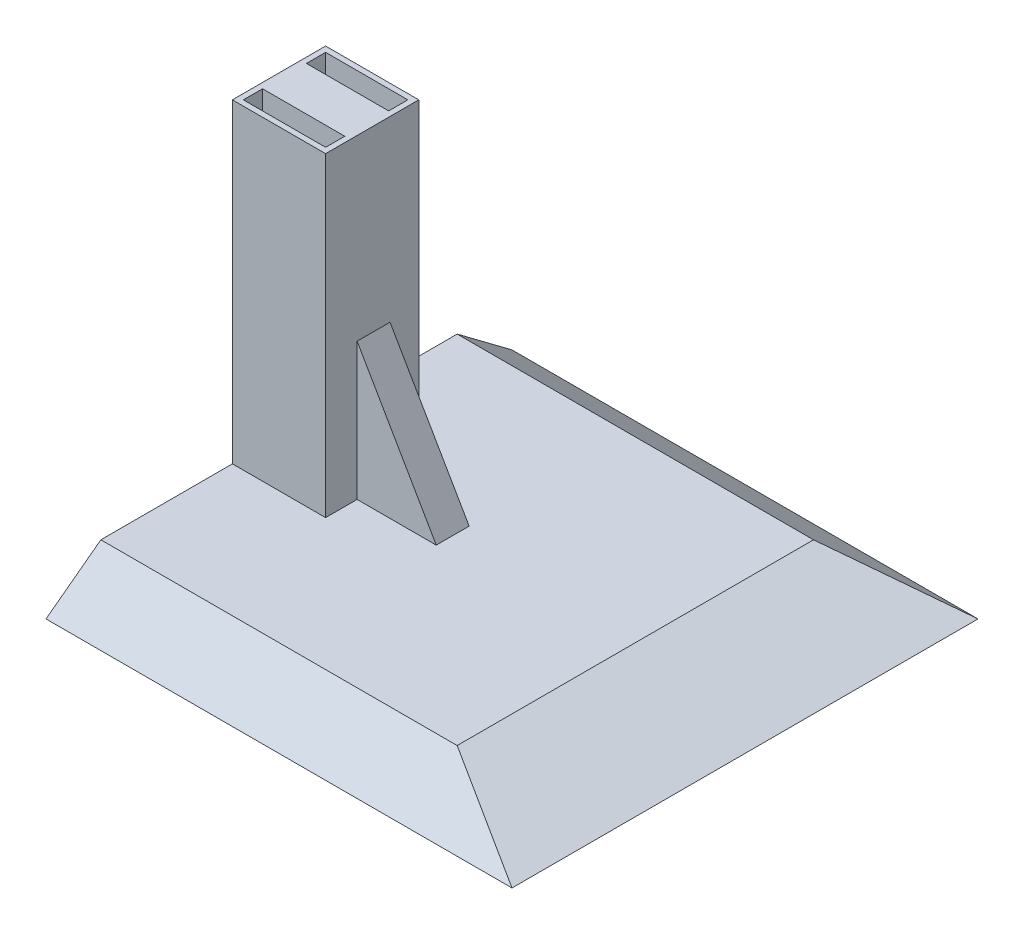
ISO-10303-21;
HEADER;
FILE_DESCRIPTION(('STEP AP214'),'2;1');
FILE_NAME('part.step','',(''),(''),'','','');
FILE_SCHEMA(('AUTOMOTIVE_DESIGN { 1 0 10303 214 1 1 1 1 }'));
ENDSEC;
DATA;
#1=APPLICATION_CONTEXT('core data for automotive mechanical design processes');
#2=APPLICATION_PROTOCOL_DEFINITION('international standard','automotive_design',2000,#1);
#3=PRODUCT_CONTEXT('',#1,'mechanical');
#4=PRODUCT('Part','Part','',(#3));
#5=PRODUCT_RELATED_PRODUCT_CATEGORY('part','',(#4));
#6=PRODUCT_DEFINITION_FORMATION('','',#4);
#7=PRODUCT_DEFINITION_CONTEXT('part definition',#1,'design');
#8=PRODUCT_DEFINITION('design','',#6,#7);
#9=PRODUCT_DEFINITION_SHAPE('','',#8);
#10=(LENGTH_UNIT() NAMED_UNIT(*) SI_UNIT(.MILLI.,.METRE.));
#11=(NAMED_UNIT(*) PLANE_ANGLE_UNIT() SI_UNIT($,.RADIAN.));
#12=(NAMED_UNIT(*) SI_UNIT($,.STERADIAN.) SOLID_ANGLE_UNIT());
#13=UNCERTAINTY_MEASURE_WITH_UNIT(LENGTH_MEASURE(1.E-05),#10,'distance_accuracy_value','');
#14=(GEOMETRIC_REPRESENTATION_CONTEXT(3) GLOBAL_UNCERTAINTY_ASSIGNED_CONTEXT((#13)) GLOBAL_UNIT_ASSIGNED_CONTEXT((#10,
#11,#12)) REPRESENTATION_CONTEXT('',''));
#15=CARTESIAN_POINT('',(0.,0.,0.));
#16=DIRECTION('',(0.,0.,1.));
#17=DIRECTION('',(1.,0.,0.));
#18=AXIS2_PLACEMENT_3D('',#15,#16,#17);
#19=CARTESIAN_POINT('',(0.,7.5,0.));
#20=DIRECTION('',(0.,1.,0.));
#21=DIRECTION('',(0.,0.,1.));
#22=AXIS2_PLACEMENT_3D('',#19,#20,#21);
#23=PLANE('',#22);
#24=DIRECTION('',(0.,0.,-1.));
#25=VECTOR('',#24,1.);
#26=CARTESIAN_POINT('',(-25.5,7.5,8.50000000000001));
#27=LINE('',#26,#25);
#28=CARTESIAN_POINT('',(-25.5,7.5,-3.25));
#29=VERTEX_POINT('',#28);
#30=CARTESIAN_POINT('',(-25.5,7.5,-8.49999999999999));
#31=VERTEX_POINT('',#30);
#32=EDGE_CURVE('E195',#29,#31,#27,.T.);
#33=ORIENTED_EDGE('',*,*,#32,.F.);
#34=DIRECTION('',(1.,0.,0.));
#35=VECTOR('',#34,1.);
#36=CARTESIAN_POINT('',(-25.5,7.5,-3.25));
#37=LINE('',#36,#35);
#38=CARTESIAN_POINT('',(-11.0662432702594,7.5,-3.25));
#39=VERTEX_POINT('',#38);
#40=EDGE_CURVE('E181',#29,#39,#37,.T.);
#41=ORIENTED_EDGE('',*,*,#40,.T.);
#42=DIRECTION('',(0.,0.,1.));
#43=VECTOR('',#42,1.);
#44=CARTESIAN_POINT('',(-11.0662432702594,7.5,-3.25));
#45=LINE('',#44,#43);
#46=CARTESIAN_POINT('',(-11.0662432702594,7.5,2.75));
#47=VERTEX_POINT('',#46);
#48=EDGE_CURVE('E490',#39,#47,#45,.T.);
#49=ORIENTED_EDGE('',*,*,#48,.T.);
#50=DIRECTION('',(1.,0.,0.));
#51=VECTOR('',#50,1.);
#52=CARTESIAN_POINT('',(-25.5,7.5,2.75));
#53=LINE('',#52,#51);
#54=CARTESIAN_POINT('',(-25.5,7.5,2.75));
#55=VERTEX_POINT('',#54);
#56=EDGE_CURVE('E489',#55,#47,#53,.T.);
#57=ORIENTED_EDGE('',*,*,#56,.F.);
#58=CARTESIAN_POINT('',(-25.5,7.5,8.50000000000001));
#59=VERTEX_POINT('',#58);
#60=EDGE_CURVE('E204',#59,#55,#27,.T.);
#61=ORIENTED_EDGE('',*,*,#60,.F.);
#62=DIRECTION('',(-1.,0.,0.));
#63=VECTOR('',#62,1.);
#64=CARTESIAN_POINT('',(-25.5,7.5,8.50000000000001));
#65=LINE('',#64,#63);
#66=CARTESIAN_POINT('',(-42.5,7.5,8.50000000000002));
#67=VERTEX_POINT('',#66);
#68=EDGE_CURVE('E205',#59,#67,#65,.T.);
#69=ORIENTED_EDGE('',*,*,#68,.T.);
#70=DIRECTION('',(0.,0.,1.));
#71=VECTOR('',#70,1.);
#72=CARTESIAN_POINT('',(-42.5,7.5,32.5));
#73=LINE('',#72,#71);
#74=CARTESIAN_POINT('',(-42.5,7.5,32.5));
#75=VERTEX_POINT('',#74);
#76=EDGE_CURVE('E316',#67,#75,#73,.T.);
#77=ORIENTED_EDGE('',*,*,#76,.T.);
#78=DIRECTION('',(1.,0.,0.));
#79=VECTOR('',#78,1.);
#80=CARTESIAN_POINT('',(22.5,7.5,32.5));
#81=LINE('',#80,#79);
#82=CARTESIAN_POINT('',(22.5,7.5,32.5));
#83=VERTEX_POINT('',#82);
#84=EDGE_CURVE('E12',#75,#83,#81,.T.);
#85=ORIENTED_EDGE('',*,*,#84,.T.);
#86=DIRECTION('',(0.,0.,-1.));
#87=VECTOR('',#86,1.);
#88=CARTESIAN_POINT('',(22.5,7.5,32.5));
#89=LINE('',#88,#87);
#90=CARTESIAN_POINT('',(22.5,7.5,-32.5));
#91=VERTEX_POINT('',#90);
#92=EDGE_CURVE('E57',#83,#91,#89,.T.);
#93=ORIENTED_EDGE('',*,*,#92,.T.);
#94=DIRECTION('',(-1.,0.,0.));
#95=VECTOR('',#94,1.);
#96=CARTESIAN_POINT('',(22.5,7.5,-32.5));
#97=LINE('',#96,#95);
#98=CARTESIAN_POINT('',(-42.5,7.5,-32.5));
#99=VERTEX_POINT('',#98);
#100=EDGE_CURVE('E397',#91,#99,#97,.T.);
#101=ORIENTED_EDGE('',*,*,#100,.T.);
#102=CARTESIAN_POINT('',(-42.5,7.5,-8.49999999999999));
#103=VERTEX_POINT('',#102);
#104=EDGE_CURVE('E51',#99,#103,#73,.T.);
#105=ORIENTED_EDGE('',*,*,#104,.T.);
#106=DIRECTION('',(-1.,0.,0.));
#107=VECTOR('',#106,1.);
#108=CARTESIAN_POINT('',(-25.5,7.5,-8.49999999999999));
#109=LINE('',#108,#107);
#110=EDGE_CURVE('E203',#31,#103,#109,.T.);
#111=ORIENTED_EDGE('',*,*,#110,.F.);
#112=EDGE_LOOP('',(#33,#41,#49,#57,#61,#69,#77,#85,#93,#101,#105,#111));
#113=FACE_BOUND('',#112,.T.);
#114=ADVANCED_FACE('F47',(#113),#23,.T.);
#115=CARTESIAN_POINT('',(-25.5,65.,8.50000000000001));
#116=DIRECTION('',(-1.,0.,0.));
#117=DIRECTION('',(0.,0.,1.));
#118=AXIS2_PLACEMENT_3D('',#115,#116,#117);
#119=PLANE('',#118);
#120=DIRECTION('',(0.,-1.,0.));
#121=VECTOR('',#120,1.);
#122=CARTESIAN_POINT('',(-25.5,32.5,-3.25));
#123=LINE('',#122,#121);
#124=CARTESIAN_POINT('',(-25.5,32.5,-3.25));
#125=VERTEX_POINT('',#124);
#126=EDGE_CURVE('E184',#125,#29,#123,.T.);
#127=ORIENTED_EDGE('',*,*,#126,.T.);
#128=ORIENTED_EDGE('',*,*,#32,.T.);
#129=DIRECTION('',(0.,-1.,0.));
#130=VECTOR('',#129,1.);
#131=CARTESIAN_POINT('',(-25.5,65.,-8.49999999999999));
#132=LINE('',#131,#130);
#133=CARTESIAN_POINT('',(-25.5,65.,-8.49999999999999));
#134=VERTEX_POINT('',#133);
#135=EDGE_CURVE('E215',#134,#31,#132,.T.);
#136=ORIENTED_EDGE('',*,*,#135,.F.);
#137=DIRECTION('',(0.,0.,-1.));
#138=VECTOR('',#137,1.);
#139=CARTESIAN_POINT('',(-25.5,65.,8.50000000000001));
#140=LINE('',#139,#138);
#141=CARTESIAN_POINT('',(-25.5,65.,8.50000000000001));
#142=VERTEX_POINT('',#141);
#143=EDGE_CURVE('E218',#142,#134,#140,.T.);
#144=ORIENTED_EDGE('',*,*,#143,.F.);
#145=DIRECTION('',(0.,-1.,0.));
#146=VECTOR('',#145,1.);
#147=CARTESIAN_POINT('',(-25.5,65.,8.50000000000001));
#148=LINE('',#147,#146);
#149=EDGE_CURVE('E217',#142,#59,#148,.T.);
#150=ORIENTED_EDGE('',*,*,#149,.T.);
#151=ORIENTED_EDGE('',*,*,#60,.T.);
#152=DIRECTION('',(0.,-1.,0.));
#153=VECTOR('',#152,1.);
#154=CARTESIAN_POINT('',(-25.5,32.5,2.75));
#155=LINE('',#154,#153);
#156=CARTESIAN_POINT('',(-25.5,32.5,2.75));
#157=VERTEX_POINT('',#156);
#158=EDGE_CURVE('E487',#157,#55,#155,.T.);
#159=ORIENTED_EDGE('',*,*,#158,.F.);
#160=DIRECTION('',(0.,0.,1.));
#161=VECTOR('',#160,1.);
#162=CARTESIAN_POINT('',(-25.5,32.5,-3.25));
#163=LINE('',#162,#161);
#164=EDGE_CURVE('E198',#125,#157,#163,.T.);
#165=ORIENTED_EDGE('',*,*,#164,.F.);
#166=EDGE_LOOP('',(#127,#128,#136,#144,#150,#151,#159,#165));
#167=FACE_BOUND('',#166,.T.);
#168=ADVANCED_FACE('F193',(#167),#119,.F.);
#169=CARTESIAN_POINT('',(0.,65.,0.));
#170=DIRECTION('',(0.,-1.,0.));
#171=DIRECTION('',(0.,0.,-1.));
#172=AXIS2_PLACEMENT_3D('',#169,#170,#171);
#173=PLANE('',#172);
#174=DIRECTION('',(-1.,0.,0.));
#175=VECTOR('',#174,1.);
#176=CARTESIAN_POINT('',(-25.5,65.,-8.49999999999999));
#177=LINE('',#176,#175);
#178=CARTESIAN_POINT('',(-42.5,65.,-8.49999999999999));
#179=VERTEX_POINT('',#178);
#180=EDGE_CURVE('E208',#134,#179,#177,.T.);
#181=ORIENTED_EDGE('',*,*,#180,.T.);
#182=DIRECTION('',(0.,0.,-1.));
#183=VECTOR('',#182,1.);
#184=CARTESIAN_POINT('',(-42.5,65.,8.50000000000001));
#185=LINE('',#184,#183);
#186=CARTESIAN_POINT('',(-42.5,65.,8.50000000000001));
#187=VERTEX_POINT('',#186);
#188=EDGE_CURVE('E470',#187,#179,#185,.T.);
#189=ORIENTED_EDGE('',*,*,#188,.F.);
#190=DIRECTION('',(-1.,0.,0.));
#191=VECTOR('',#190,1.);
#192=CARTESIAN_POINT('',(-25.5,65.,8.50000000000001));
#193=LINE('',#192,#191);
#194=EDGE_CURVE('E473',#142,#187,#193,.T.);
#195=ORIENTED_EDGE('',*,*,#194,.F.);
#196=ORIENTED_EDGE('',*,*,#143,.T.);
#197=EDGE_LOOP('',(#181,#189,#195,#196));
#198=FACE_BOUND('',#197,.T.);
#199=DIRECTION('',(-1.,0.,0.));
#200=VECTOR('',#199,1.);
#201=CARTESIAN_POINT('',(0.,65.,4.00000000000001));
#202=LINE('',#201,#200);
#203=CARTESIAN_POINT('',(-26.5,65.,4.00000000000001));
#204=VERTEX_POINT('',#203);
#205=CARTESIAN_POINT('',(-41.5,65.,4.00000000000001));
#206=VERTEX_POINT('',#205);
#207=EDGE_CURVE('E453',#204,#206,#202,.T.);
#208=ORIENTED_EDGE('',*,*,#207,.F.);
#209=DIRECTION('',(0.,0.,-1.));
#210=VECTOR('',#209,1.);
#211=CARTESIAN_POINT('',(-26.5,65.,0.));
#212=LINE('',#211,#210);
#213=CARTESIAN_POINT('',(-26.5,65.,7.5));
#214=VERTEX_POINT('',#213);
#215=EDGE_CURVE('E451',#214,#204,#212,.T.);
#216=ORIENTED_EDGE('',*,*,#215,.F.);
#217=DIRECTION('',(-1.,0.,0.));
#218=VECTOR('',#217,1.);
#219=CARTESIAN_POINT('',(0.,65.,7.5));
#220=LINE('',#219,#218);
#221=CARTESIAN_POINT('',(-41.5,65.,7.50000000000001));
#222=VERTEX_POINT('',#221);
#223=EDGE_CURVE('E443',#214,#222,#220,.T.);
#224=ORIENTED_EDGE('',*,*,#223,.T.);
#225=DIRECTION('',(0.,0.,-1.));
#226=VECTOR('',#225,1.);
#227=CARTESIAN_POINT('',(-41.5,65.,0.));
#228=LINE('',#227,#226);
#229=EDGE_CURVE('E456',#222,#206,#228,.T.);
#230=ORIENTED_EDGE('',*,*,#229,.T.);
#231=EDGE_LOOP('',(#208,#216,#224,#230));
#232=FACE_BOUND('',#231,.T.);
#233=DIRECTION('',(-1.,0.,0.));
#234=VECTOR('',#233,1.);
#235=CARTESIAN_POINT('',(0.,65.,-3.99999999999999));
#236=LINE('',#235,#234);
#237=CARTESIAN_POINT('',(-26.5,65.,-3.99999999999999));
#238=VERTEX_POINT('',#237);
#239=CARTESIAN_POINT('',(-41.5,65.,-3.99999999999999));
#240=VERTEX_POINT('',#239);
#241=EDGE_CURVE('E73',#238,#240,#236,.T.);
#242=ORIENTED_EDGE('',*,*,#241,.T.);
#243=DIRECTION('',(0.,0.,-1.));
#244=VECTOR('',#243,1.);
#245=CARTESIAN_POINT('',(-41.5,65.,0.));
#246=LINE('',#245,#244);
#247=CARTESIAN_POINT('',(-41.5,65.,-7.49999999999999));
#248=VERTEX_POINT('',#247);
#249=EDGE_CURVE('E432',#240,#248,#246,.T.);
#250=ORIENTED_EDGE('',*,*,#249,.T.);
#251=DIRECTION('',(-1.,0.,0.));
#252=VECTOR('',#251,1.);
#253=CARTESIAN_POINT('',(0.,65.,-7.5));
#254=LINE('',#253,#252);
#255=CARTESIAN_POINT('',(-26.5,65.,-7.49999999999999));
#256=VERTEX_POINT('',#255);
#257=EDGE_CURVE('E510',#256,#248,#254,.T.);
#258=ORIENTED_EDGE('',*,*,#257,.F.);
#259=DIRECTION('',(0.,0.,-1.));
#260=VECTOR('',#259,1.);
#261=CARTESIAN_POINT('',(-26.5,65.,0.));
#262=LINE('',#261,#260);
#263=EDGE_CURVE('E508',#238,#256,#262,.T.);
#264=ORIENTED_EDGE('',*,*,#263,.F.);
#265=EDGE_LOOP('',(#242,#250,#258,#264));
#266=FACE_BOUND('',#265,.T.);
#267=ADVANCED_FACE('F478',(#198,#232,#266),#173,.F.);
#268=CARTESIAN_POINT('',(0.,0.,0.));
#269=DIRECTION('',(0.,-1.,0.));
#270=DIRECTION('',(0.,0.,-1.));
#271=AXIS2_PLACEMENT_3D('',#268,#269,#270);
#272=PLANE('',#271);
#273=DIRECTION('',(0.,0.,-1.));
#274=VECTOR('',#273,1.);
#275=CARTESIAN_POINT('',(42.5,0.,42.5));
#276=LINE('',#275,#274);
#277=CARTESIAN_POINT('',(42.5,0.,42.5));
#278=VERTEX_POINT('',#277);
#279=CARTESIAN_POINT('',(42.5,0.,-42.5));
#280=VERTEX_POINT('',#279);
#281=EDGE_CURVE('E351',#278,#280,#276,.T.);
#282=ORIENTED_EDGE('',*,*,#281,.F.);
#283=DIRECTION('',(1.,0.,0.));
#284=VECTOR('',#283,1.);
#285=CARTESIAN_POINT('',(-42.5,0.,42.5));
#286=LINE('',#285,#284);
#287=CARTESIAN_POINT('',(-42.5,0.,42.5));
#288=VERTEX_POINT('',#287);
#289=EDGE_CURVE('E226',#288,#278,#286,.T.);
#290=ORIENTED_EDGE('',*,*,#289,.F.);
#291=DIRECTION('',(0.,0.,1.));
#292=VECTOR('',#291,1.);
#293=CARTESIAN_POINT('',(-42.5,0.,42.5));
#294=LINE('',#293,#292);
#295=CARTESIAN_POINT('',(-42.5,0.,-42.5));
#296=VERTEX_POINT('',#295);
#297=EDGE_CURVE('E322',#296,#288,#294,.T.);
#298=ORIENTED_EDGE('',*,*,#297,.F.);
#299=DIRECTION('',(-1.,0.,0.));
#300=VECTOR('',#299,1.);
#301=CARTESIAN_POINT('',(-42.5,0.,-42.5));
#302=LINE('',#301,#300);
#303=EDGE_CURVE('E305',#280,#296,#302,.T.);
#304=ORIENTED_EDGE('',*,*,#303,.F.);
#305=EDGE_LOOP('',(#282,#290,#298,#304));
#306=FACE_BOUND('',#305,.T.);
#307=ADVANCED_FACE('F245',(#306),#272,.T.);
#308=CARTESIAN_POINT('',(0.,20.4,15.3));
#309=DIRECTION('',(0.,-0.799999999999999,-0.600000000000001));
#310=DIRECTION('',(0.,0.600000000000001,-0.799999999999999));
#311=AXIS2_PLACEMENT_3D('',#308,#309,#310);
#312=PLANE('',#311);
#313=DIRECTION('',(-0.847998304005088,0.317999364001908,-0.423999152002544));
#314=VECTOR('',#313,1.);
#315=CARTESIAN_POINT('',(42.5,0.,42.5));
#316=LINE('',#315,#314);
#317=EDGE_CURVE('E335',#278,#83,#316,.T.);
#318=ORIENTED_EDGE('',*,*,#317,.T.);
#319=ORIENTED_EDGE('',*,*,#84,.F.);
#320=DIRECTION('',(0.,0.600000000000001,-0.799999999999999));
#321=VECTOR('',#320,1.);
#322=CARTESIAN_POINT('',(-42.5,0.,42.5));
#323=LINE('',#322,#321);
#324=EDGE_CURVE('E232',#288,#75,#323,.T.);
#325=ORIENTED_EDGE('',*,*,#324,.F.);
#326=ORIENTED_EDGE('',*,*,#289,.T.);
#327=EDGE_LOOP('',(#318,#319,#325,#326));
#328=FACE_BOUND('',#327,.T.);
#329=ADVANCED_FACE('F234',(#328),#312,.F.);
#330=CARTESIAN_POINT('',(-42.5,0.,0.));
#331=DIRECTION('',(1.,0.,0.));
#332=DIRECTION('',(0.,0.,-1.));
#333=AXIS2_PLACEMENT_3D('',#330,#331,#332);
#334=PLANE('',#333);
#335=ORIENTED_EDGE('',*,*,#324,.T.);
#336=ORIENTED_EDGE('',*,*,#76,.F.);
#337=DIRECTION('',(0.,-1.,0.));
#338=VECTOR('',#337,1.);
#339=CARTESIAN_POINT('',(-42.5,65.,8.50000000000001));
#340=LINE('',#339,#338);
#341=EDGE_CURVE('E220',#187,#67,#340,.T.);
#342=ORIENTED_EDGE('',*,*,#341,.F.);
#343=ORIENTED_EDGE('',*,*,#188,.T.);
#344=DIRECTION('',(0.,-1.,0.));
#345=VECTOR('',#344,1.);
#346=CARTESIAN_POINT('',(-42.5,65.,-8.49999999999999));
#347=LINE('',#346,#345);
#348=EDGE_CURVE('E353',#179,#103,#347,.T.);
#349=ORIENTED_EDGE('',*,*,#348,.T.);
#350=ORIENTED_EDGE('',*,*,#104,.F.);
#351=DIRECTION('',(0.,0.6,0.8));
#352=VECTOR('',#351,1.);
#353=CARTESIAN_POINT('',(-42.5,0.,-42.5));
#354=LINE('',#353,#352);
#355=EDGE_CURVE('E297',#296,#99,#354,.T.);
#356=ORIENTED_EDGE('',*,*,#355,.F.);
#357=ORIENTED_EDGE('',*,*,#297,.T.);
#358=EDGE_LOOP('',(#335,#336,#342,#343,#349,#350,#356,#357));
#359=FACE_BOUND('',#358,.T.);
#360=ADVANCED_FACE('F244',(#359),#334,.F.);
#361=CARTESIAN_POINT('',(5.23972602739726,13.972602739726,0.));
#362=DIRECTION('',(-0.351123441588392,-0.936329177569045,0.));
#363=DIRECTION('',(0.936329177569045,-0.351123441588392,0.));
#364=AXIS2_PLACEMENT_3D('',#361,#362,#363);
#365=PLANE('',#364);
#366=DIRECTION('',(-0.847998304005088,0.317999364001908,0.423999152002544));
#367=VECTOR('',#366,1.);
#368=CARTESIAN_POINT('',(42.5,0.,-42.5));
#369=LINE('',#368,#367);
#370=EDGE_CURVE('E290',#280,#91,#369,.T.);
#371=ORIENTED_EDGE('',*,*,#370,.T.);
#372=ORIENTED_EDGE('',*,*,#92,.F.);
#373=ORIENTED_EDGE('',*,*,#317,.F.);
#374=ORIENTED_EDGE('',*,*,#281,.T.);
#375=EDGE_LOOP('',(#371,#372,#373,#374));
#376=FACE_BOUND('',#375,.T.);
#377=ADVANCED_FACE('F272',(#376),#365,.F.);
#378=CARTESIAN_POINT('',(0.,20.4,-15.3));
#379=DIRECTION('',(0.,-0.8,0.6));
#380=DIRECTION('',(0.,-0.6,-0.8));
#381=AXIS2_PLACEMENT_3D('',#378,#379,#380);
#382=PLANE('',#381);
#383=ORIENTED_EDGE('',*,*,#355,.T.);
#384=ORIENTED_EDGE('',*,*,#100,.F.);
#385=ORIENTED_EDGE('',*,*,#370,.F.);
#386=ORIENTED_EDGE('',*,*,#303,.T.);
#387=EDGE_LOOP('',(#383,#384,#385,#386));
#388=FACE_BOUND('',#387,.T.);
#389=ADVANCED_FACE('F280',(#388),#382,.F.);
#390=CARTESIAN_POINT('',(-25.5,65.,-8.49999999999999));
#391=DIRECTION('',(0.,0.,1.));
#392=DIRECTION('',(1.,0.,0.));
#393=AXIS2_PLACEMENT_3D('',#390,#391,#392);
#394=PLANE('',#393);
#395=ORIENTED_EDGE('',*,*,#110,.T.);
#396=ORIENTED_EDGE('',*,*,#348,.F.);
#397=ORIENTED_EDGE('',*,*,#180,.F.);
#398=ORIENTED_EDGE('',*,*,#135,.T.);
#399=EDGE_LOOP('',(#395,#396,#397,#398));
#400=FACE_BOUND('',#399,.T.);
#401=ADVANCED_FACE('F482',(#400),#394,.F.);
#402=CARTESIAN_POINT('',(-25.5,65.,8.50000000000001));
#403=DIRECTION('',(0.,0.,1.));
#404=DIRECTION('',(1.,0.,0.));
#405=AXIS2_PLACEMENT_3D('',#402,#403,#404);
#406=PLANE('',#405);
#407=ORIENTED_EDGE('',*,*,#68,.F.);
#408=ORIENTED_EDGE('',*,*,#149,.F.);
#409=ORIENTED_EDGE('',*,*,#194,.T.);
#410=ORIENTED_EDGE('',*,*,#341,.T.);
#411=EDGE_LOOP('',(#407,#408,#409,#410));
#412=FACE_BOUND('',#411,.T.);
#413=ADVANCED_FACE('F485',(#412),#406,.T.);
#414=CARTESIAN_POINT('',(-26.5,40.,0.));
#415=DIRECTION('',(1.,0.,0.));
#416=DIRECTION('',(0.,0.,-1.));
#417=AXIS2_PLACEMENT_3D('',#414,#415,#416);
#418=PLANE('',#417);
#419=ORIENTED_EDGE('',*,*,#215,.T.);
#420=DIRECTION('',(0.,1.,0.));
#421=VECTOR('',#420,1.);
#422=CARTESIAN_POINT('',(-26.5,40.,4.00000000000001));
#423=LINE('',#422,#421);
#424=CARTESIAN_POINT('',(-26.5,40.,4.00000000000001));
#425=VERTEX_POINT('',#424);
#426=EDGE_CURVE('E450',#425,#204,#423,.T.);
#427=ORIENTED_EDGE('',*,*,#426,.F.);
#428=DIRECTION('',(0.,0.,-1.));
#429=VECTOR('',#428,1.);
#430=CARTESIAN_POINT('',(-26.5,40.,0.));
#431=LINE('',#430,#429);
#432=CARTESIAN_POINT('',(-26.5,40.,7.5));
#433=VERTEX_POINT('',#432);
#434=EDGE_CURVE('E439',#433,#425,#431,.T.);
#435=ORIENTED_EDGE('',*,*,#434,.F.);
#436=DIRECTION('',(0.,1.,0.));
#437=VECTOR('',#436,1.);
#438=CARTESIAN_POINT('',(-26.5,40.,7.5));
#439=LINE('',#438,#437);
#440=EDGE_CURVE('E461',#433,#214,#439,.T.);
#441=ORIENTED_EDGE('',*,*,#440,.T.);
#442=EDGE_LOOP('',(#419,#427,#435,#441));
#443=FACE_BOUND('',#442,.T.);
#444=ADVANCED_FACE('F553',(#443),#418,.F.);
#445=CARTESIAN_POINT('',(0.,40.,7.5));
#446=DIRECTION('',(0.,0.,-1.));
#447=DIRECTION('',(-1.,0.,0.));
#448=AXIS2_PLACEMENT_3D('',#445,#446,#447);
#449=PLANE('',#448);
#450=ORIENTED_EDGE('',*,*,#223,.F.);
#451=ORIENTED_EDGE('',*,*,#440,.F.);
#452=DIRECTION('',(-1.,0.,0.));
#453=VECTOR('',#452,1.);
#454=CARTESIAN_POINT('',(0.,40.,7.5));
#455=LINE('',#454,#453);
#456=CARTESIAN_POINT('',(-41.5,40.,7.50000000000001));
#457=VERTEX_POINT('',#456);
#458=EDGE_CURVE('E448',#433,#457,#455,.T.);
#459=ORIENTED_EDGE('',*,*,#458,.T.);
#460=DIRECTION('',(0.,1.,0.));
#461=VECTOR('',#460,1.);
#462=CARTESIAN_POINT('',(-41.5,40.,7.50000000000001));
#463=LINE('',#462,#461);
#464=EDGE_CURVE('E463',#457,#222,#463,.T.);
#465=ORIENTED_EDGE('',*,*,#464,.T.);
#466=EDGE_LOOP('',(#450,#451,#459,#465));
#467=FACE_BOUND('',#466,.T.);
#468=ADVANCED_FACE('F700',(#467),#449,.T.);
#469=CARTESIAN_POINT('',(-41.5,40.,0.));
#470=DIRECTION('',(1.,0.,0.));
#471=DIRECTION('',(0.,0.,-1.));
#472=AXIS2_PLACEMENT_3D('',#469,#470,#471);
#473=PLANE('',#472);
#474=ORIENTED_EDGE('',*,*,#229,.F.);
#475=ORIENTED_EDGE('',*,*,#464,.F.);
#476=DIRECTION('',(0.,0.,-1.));
#477=VECTOR('',#476,1.);
#478=CARTESIAN_POINT('',(-41.5,40.,0.));
#479=LINE('',#478,#477);
#480=CARTESIAN_POINT('',(-41.5,40.,4.00000000000001));
#481=VERTEX_POINT('',#480);
#482=EDGE_CURVE('E446',#457,#481,#479,.T.);
#483=ORIENTED_EDGE('',*,*,#482,.T.);
#484=DIRECTION('',(0.,1.,0.));
#485=VECTOR('',#484,1.);
#486=CARTESIAN_POINT('',(-41.5,40.,4.00000000000001));
#487=LINE('',#486,#485);
#488=EDGE_CURVE('E465',#481,#206,#487,.T.);
#489=ORIENTED_EDGE('',*,*,#488,.T.);
#490=EDGE_LOOP('',(#474,#475,#483,#489));
#491=FACE_BOUND('',#490,.T.);
#492=ADVANCED_FACE('F691',(#491),#473,.T.);
#493=CARTESIAN_POINT('',(0.,40.,4.00000000000001));
#494=DIRECTION('',(0.,0.,-1.));
#495=DIRECTION('',(-1.,0.,0.));
#496=AXIS2_PLACEMENT_3D('',#493,#494,#495);
#497=PLANE('',#496);
#498=ORIENTED_EDGE('',*,*,#207,.T.);
#499=ORIENTED_EDGE('',*,*,#488,.F.);
#500=DIRECTION('',(-1.,0.,0.));
#501=VECTOR('',#500,1.);
#502=CARTESIAN_POINT('',(0.,40.,4.00000000000001));
#503=LINE('',#502,#501);
#504=EDGE_CURVE('E442',#425,#481,#503,.T.);
#505=ORIENTED_EDGE('',*,*,#504,.F.);
#506=ORIENTED_EDGE('',*,*,#426,.T.);
#507=EDGE_LOOP('',(#498,#499,#505,#506));
#508=FACE_BOUND('',#507,.T.);
#509=ADVANCED_FACE('F537',(#508),#497,.F.);
#510=CARTESIAN_POINT('',(0.,40.,0.));
#511=DIRECTION('',(0.,1.,0.));
#512=DIRECTION('',(0.,0.,1.));
#513=AXIS2_PLACEMENT_3D('',#510,#511,#512);
#514=PLANE('',#513);
#515=ORIENTED_EDGE('',*,*,#434,.T.);
#516=ORIENTED_EDGE('',*,*,#504,.T.);
#517=ORIENTED_EDGE('',*,*,#482,.F.);
#518=ORIENTED_EDGE('',*,*,#458,.F.);
#519=EDGE_LOOP('',(#515,#516,#517,#518));
#520=FACE_BOUND('',#519,.T.);
#521=ADVANCED_FACE('F530',(#520),#514,.T.);
#522=CARTESIAN_POINT('',(0.,40.,-3.99999999999999));
#523=DIRECTION('',(0.,0.,-1.));
#524=DIRECTION('',(-1.,0.,0.));
#525=AXIS2_PLACEMENT_3D('',#522,#523,#524);
#526=PLANE('',#525);
#527=ORIENTED_EDGE('',*,*,#241,.F.);
#528=DIRECTION('',(0.,1.,0.));
#529=VECTOR('',#528,1.);
#530=CARTESIAN_POINT('',(-26.5,40.,-3.99999999999999));
#531=LINE('',#530,#529);
#532=CARTESIAN_POINT('',(-26.5,40.,-3.99999999999999));
#533=VERTEX_POINT('',#532);
#534=EDGE_CURVE('E436',#533,#238,#531,.T.);
#535=ORIENTED_EDGE('',*,*,#534,.F.);
#536=DIRECTION('',(-1.,0.,0.));
#537=VECTOR('',#536,1.);
#538=CARTESIAN_POINT('',(0.,40.,-3.99999999999999));
#539=LINE('',#538,#537);
#540=CARTESIAN_POINT('',(-41.5,40.,-3.99999999999999));
#541=VERTEX_POINT('',#540);
#542=EDGE_CURVE('E498',#533,#541,#539,.T.);
#543=ORIENTED_EDGE('',*,*,#542,.T.);
#544=DIRECTION('',(0.,1.,0.));
#545=VECTOR('',#544,1.);
#546=CARTESIAN_POINT('',(-41.5,40.,-3.99999999999999));
#547=LINE('',#546,#545);
#548=EDGE_CURVE('E421',#541,#240,#547,.T.);
#549=ORIENTED_EDGE('',*,*,#548,.T.);
#550=EDGE_LOOP('',(#527,#535,#543,#549));
#551=FACE_BOUND('',#550,.T.);
#552=ADVANCED_FACE('F528',(#551),#526,.T.);
#553=CARTESIAN_POINT('',(-41.5,40.,0.));
#554=DIRECTION('',(1.,0.,0.));
#555=DIRECTION('',(0.,0.,-1.));
#556=AXIS2_PLACEMENT_3D('',#553,#554,#555);
#557=PLANE('',#556);
#558=ORIENTED_EDGE('',*,*,#249,.F.);
#559=ORIENTED_EDGE('',*,*,#548,.F.);
#560=DIRECTION('',(0.,0.,-1.));
#561=VECTOR('',#560,1.);
#562=CARTESIAN_POINT('',(-41.5,40.,0.));
#563=LINE('',#562,#561);
#564=CARTESIAN_POINT('',(-41.5,40.,-7.49999999999999));
#565=VERTEX_POINT('',#564);
#566=EDGE_CURVE('E438',#541,#565,#563,.T.);
#567=ORIENTED_EDGE('',*,*,#566,.T.);
#568=DIRECTION('',(0.,1.,0.));
#569=VECTOR('',#568,1.);
#570=CARTESIAN_POINT('',(-41.5,40.,-7.49999999999999));
#571=LINE('',#570,#569);
#572=EDGE_CURVE('E425',#565,#248,#571,.T.);
#573=ORIENTED_EDGE('',*,*,#572,.T.);
#574=EDGE_LOOP('',(#558,#559,#567,#573));
#575=FACE_BOUND('',#574,.T.);
#576=ADVANCED_FACE('F519',(#575),#557,.T.);
#577=CARTESIAN_POINT('',(0.,40.,-7.5));
#578=DIRECTION('',(0.,0.,-1.));
#579=DIRECTION('',(-1.,0.,0.));
#580=AXIS2_PLACEMENT_3D('',#577,#578,#579);
#581=PLANE('',#580);
#582=ORIENTED_EDGE('',*,*,#257,.T.);
#583=ORIENTED_EDGE('',*,*,#572,.F.);
#584=DIRECTION('',(-1.,0.,0.));
#585=VECTOR('',#584,1.);
#586=CARTESIAN_POINT('',(0.,40.,-7.5));
#587=LINE('',#586,#585);
#588=CARTESIAN_POINT('',(-26.5,40.,-7.49999999999999));
#589=VERTEX_POINT('',#588);
#590=EDGE_CURVE('E503',#589,#565,#587,.T.);
#591=ORIENTED_EDGE('',*,*,#590,.F.);
#592=DIRECTION('',(0.,1.,0.));
#593=VECTOR('',#592,1.);
#594=CARTESIAN_POINT('',(-26.5,40.,-7.49999999999999));
#595=LINE('',#594,#593);
#596=EDGE_CURVE('E429',#589,#256,#595,.T.);
#597=ORIENTED_EDGE('',*,*,#596,.T.);
#598=EDGE_LOOP('',(#582,#583,#591,#597));
#599=FACE_BOUND('',#598,.T.);
#600=ADVANCED_FACE('F521',(#599),#581,.F.);
#601=CARTESIAN_POINT('',(-26.5,40.,0.));
#602=DIRECTION('',(1.,0.,0.));
#603=DIRECTION('',(0.,0.,-1.));
#604=AXIS2_PLACEMENT_3D('',#601,#602,#603);
#605=PLANE('',#604);
#606=ORIENTED_EDGE('',*,*,#263,.T.);
#607=ORIENTED_EDGE('',*,*,#596,.F.);
#608=DIRECTION('',(0.,0.,-1.));
#609=VECTOR('',#608,1.);
#610=CARTESIAN_POINT('',(-26.5,40.,0.));
#611=LINE('',#610,#609);
#612=EDGE_CURVE('E500',#533,#589,#611,.T.);
#613=ORIENTED_EDGE('',*,*,#612,.F.);
#614=ORIENTED_EDGE('',*,*,#534,.T.);
#615=EDGE_LOOP('',(#606,#607,#613,#614));
#616=FACE_BOUND('',#615,.T.);
#617=ADVANCED_FACE('F527',(#616),#605,.F.);
#618=CARTESIAN_POINT('',(0.,40.,0.));
#619=DIRECTION('',(0.,1.,0.));
#620=DIRECTION('',(0.,0.,1.));
#621=AXIS2_PLACEMENT_3D('',#618,#619,#620);
#622=PLANE('',#621);
#623=ORIENTED_EDGE('',*,*,#542,.F.);
#624=ORIENTED_EDGE('',*,*,#612,.T.);
#625=ORIENTED_EDGE('',*,*,#590,.T.);
#626=ORIENTED_EDGE('',*,*,#566,.F.);
#627=EDGE_LOOP('',(#623,#624,#625,#626));
#628=FACE_BOUND('',#627,.T.);
#629=ADVANCED_FACE('F524',(#628),#622,.T.);
#630=CARTESIAN_POINT('',(-25.5,32.5,-3.25));
#631=DIRECTION('',(0.86602540378444,0.499999999999998,0.));
#632=DIRECTION('',(-0.499999999999998,0.86602540378444,0.));
#633=AXIS2_PLACEMENT_3D('',#630,#631,#632);
#634=PLANE('',#633);
#635=DIRECTION('',(-0.499999999999998,0.86602540378444,0.));
#636=VECTOR('',#635,1.);
#637=CARTESIAN_POINT('',(-25.5,32.5,2.75));
#638=LINE('',#637,#636);
#639=EDGE_CURVE('E65',#47,#157,#638,.T.);
#640=ORIENTED_EDGE('',*,*,#639,.F.);
#641=ORIENTED_EDGE('',*,*,#48,.F.);
#642=DIRECTION('',(-0.499999999999998,0.86602540378444,0.));
#643=VECTOR('',#642,1.);
#644=CARTESIAN_POINT('',(-25.5,32.5,-3.25));
#645=LINE('',#644,#643);
#646=EDGE_CURVE('E186',#39,#125,#645,.T.);
#647=ORIENTED_EDGE('',*,*,#646,.T.);
#648=ORIENTED_EDGE('',*,*,#164,.T.);
#649=EDGE_LOOP('',(#640,#641,#647,#648));
#650=FACE_BOUND('',#649,.T.);
#651=ADVANCED_FACE('F607',(#650),#634,.T.);
#652=CARTESIAN_POINT('',(0.,0.,-3.25));
#653=DIRECTION('',(0.,0.,1.));
#654=DIRECTION('',(1.,0.,0.));
#655=AXIS2_PLACEMENT_3D('',#652,#653,#654);
#656=PLANE('',#655);
#657=ORIENTED_EDGE('',*,*,#126,.F.);
#658=ORIENTED_EDGE('',*,*,#646,.F.);
#659=ORIENTED_EDGE('',*,*,#40,.F.);
#660=EDGE_LOOP('',(#657,#658,#659));
#661=FACE_BOUND('',#660,.T.);
#662=ADVANCED_FACE('F183',(#661),#656,.F.);
#663=CARTESIAN_POINT('',(0.,0.,2.75));
#664=DIRECTION('',(0.,0.,1.));
#665=DIRECTION('',(1.,0.,0.));
#666=AXIS2_PLACEMENT_3D('',#663,#664,#665);
#667=PLANE('',#666);
#668=ORIENTED_EDGE('',*,*,#158,.T.);
#669=ORIENTED_EDGE('',*,*,#56,.T.);
#670=ORIENTED_EDGE('',*,*,#639,.T.);
#671=EDGE_LOOP('',(#668,#669,#670));
#672=FACE_BOUND('',#671,.T.);
#673=ADVANCED_FACE('F635',(#672),#667,.T.);
#674=CLOSED_SHELL('',(#114,#168,#267,#307,#329,#360,#377,#389,#401,#413,#444,#468,#492,#509,
#521,#552,#576,#600,#617,#629,#651,#662,#673));
#675=MANIFOLD_SOLID_BREP('B2',#674);
#676=ADVANCED_BREP_SHAPE_REPRESENTATION('',(#18,#675),#14);
#677=SHAPE_DEFINITION_REPRESENTATION(#9,#676);
ENDSEC;
END-ISO-10303-21;
